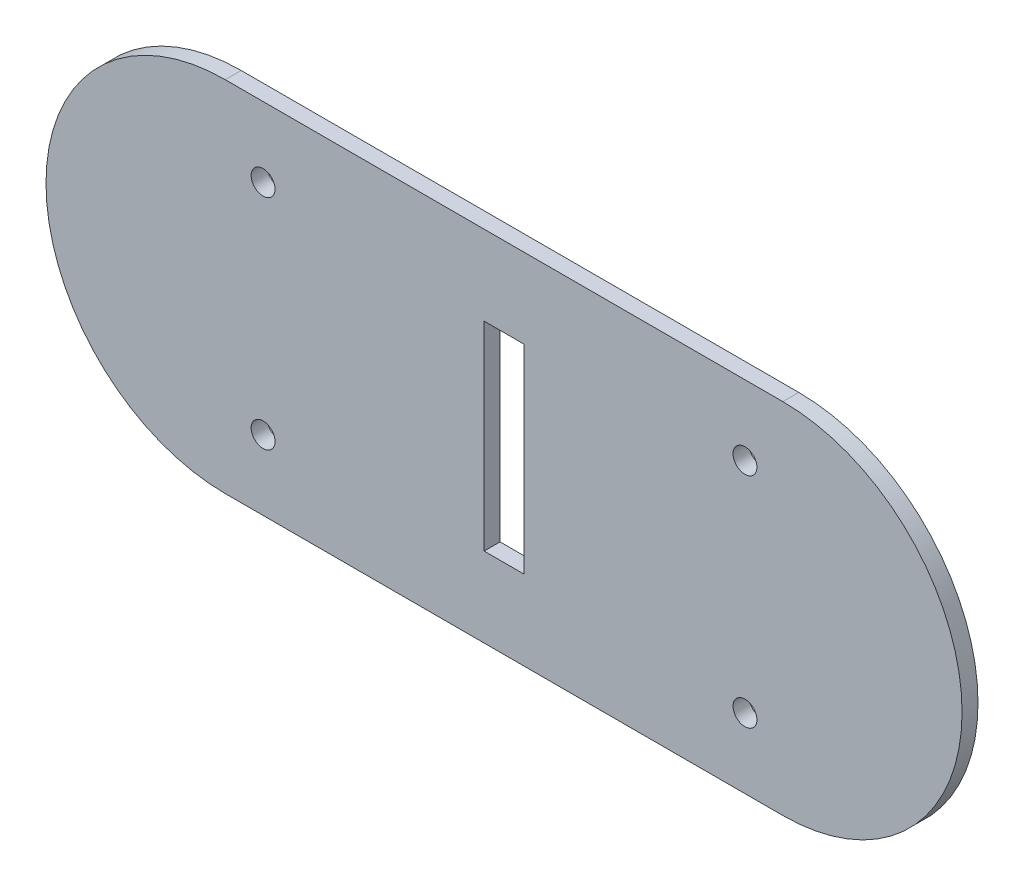
ISO-10303-21;
HEADER;
FILE_DESCRIPTION(('STEP AP214'),'2;1');
FILE_NAME('part.step','',(''),(''),'','','');
FILE_SCHEMA(('AUTOMOTIVE_DESIGN { 1 0 10303 214 1 1 1 1 }'));
ENDSEC;
DATA;
#1=APPLICATION_CONTEXT('core data for automotive mechanical design processes');
#2=APPLICATION_PROTOCOL_DEFINITION('international standard','automotive_design',2000,#1);
#3=PRODUCT_CONTEXT('',#1,'mechanical');
#4=PRODUCT('Part','Part','',(#3));
#5=PRODUCT_RELATED_PRODUCT_CATEGORY('part','',(#4));
#6=PRODUCT_DEFINITION_FORMATION('','',#4);
#7=PRODUCT_DEFINITION_CONTEXT('part definition',#1,'design');
#8=PRODUCT_DEFINITION('design','',#6,#7);
#9=PRODUCT_DEFINITION_SHAPE('','',#8);
#10=(LENGTH_UNIT() NAMED_UNIT(*) SI_UNIT(.MILLI.,.METRE.));
#11=(NAMED_UNIT(*) PLANE_ANGLE_UNIT() SI_UNIT($,.RADIAN.));
#12=(NAMED_UNIT(*) SI_UNIT($,.STERADIAN.) SOLID_ANGLE_UNIT());
#13=UNCERTAINTY_MEASURE_WITH_UNIT(LENGTH_MEASURE(1.E-05),#10,'distance_accuracy_value','');
#14=(GEOMETRIC_REPRESENTATION_CONTEXT(3) GLOBAL_UNCERTAINTY_ASSIGNED_CONTEXT((#13)) GLOBAL_UNIT_ASSIGNED_CONTEXT((#10,
#11,#12)) REPRESENTATION_CONTEXT('',''));
#15=CARTESIAN_POINT('',(0.,0.,0.));
#16=DIRECTION('',(0.,0.,1.));
#17=DIRECTION('',(1.,0.,0.));
#18=AXIS2_PLACEMENT_3D('',#15,#16,#17);
#19=CARTESIAN_POINT('',(90.1646015852963,212.057553234732,190.475370577193));
#20=DIRECTION('',(0.,0.,-1.));
#21=DIRECTION('',(-1.,0.,0.));
#22=AXIS2_PLACEMENT_3D('',#19,#20,#21);
#23=CYLINDRICAL_SURFACE('',#22,22.5);
#24=CARTESIAN_POINT('',(90.1646015852963,212.057553234732,188.475370577193));
#25=DIRECTION('',(0.,0.,1.));
#26=DIRECTION('',(1.,0.,0.));
#27=AXIS2_PLACEMENT_3D('',#24,#25,#26);
#28=CIRCLE('',#27,22.5);
#29=CARTESIAN_POINT('',(90.1646015852963,189.557553234732,188.475370577193));
#30=VERTEX_POINT('',#29);
#31=CARTESIAN_POINT('',(90.1646015852963,234.557553234732,188.475370577193));
#32=VERTEX_POINT('',#31);
#33=EDGE_CURVE('E149',#30,#32,#28,.T.);
#34=ORIENTED_EDGE('',*,*,#33,.T.);
#35=DIRECTION('',(0.,0.,-1.));
#36=VECTOR('',#35,1.);
#37=CARTESIAN_POINT('',(90.1646015852963,234.557553234732,190.475370577193));
#38=LINE('',#37,#36);
#39=CARTESIAN_POINT('',(90.1646015852963,234.557553234732,190.475370577193));
#40=VERTEX_POINT('',#39);
#41=EDGE_CURVE('E178',#40,#32,#38,.T.);
#42=ORIENTED_EDGE('',*,*,#41,.F.);
#43=CARTESIAN_POINT('',(90.1646015852963,212.057553234732,190.475370577193));
#44=DIRECTION('',(0.,0.,1.));
#45=DIRECTION('',(1.,0.,0.));
#46=AXIS2_PLACEMENT_3D('',#43,#44,#45);
#47=CIRCLE('',#46,22.5);
#48=CARTESIAN_POINT('',(90.1646015852963,189.557553234732,190.475370577193));
#49=VERTEX_POINT('',#48);
#50=EDGE_CURVE('E152',#49,#40,#47,.T.);
#51=ORIENTED_EDGE('',*,*,#50,.F.);
#52=DIRECTION('',(0.,0.,-1.));
#53=VECTOR('',#52,1.);
#54=CARTESIAN_POINT('',(90.1646015852963,189.557553234732,190.475370577193));
#55=LINE('',#54,#53);
#56=EDGE_CURVE('E162',#49,#30,#55,.T.);
#57=ORIENTED_EDGE('',*,*,#56,.T.);
#58=EDGE_LOOP('',(#34,#42,#51,#57));
#59=FACE_BOUND('',#58,.T.);
#60=ADVANCED_FACE('F35',(#59),#23,.T.);
#61=CARTESIAN_POINT('',(90.1646015852963,234.557553234732,190.475370577193));
#62=DIRECTION('',(0.,-1.,0.));
#63=DIRECTION('',(0.,0.,-1.));
#64=AXIS2_PLACEMENT_3D('',#61,#62,#63);
#65=PLANE('',#64);
#66=DIRECTION('',(-1.,0.,0.));
#67=VECTOR('',#66,1.);
#68=CARTESIAN_POINT('',(90.1646015852963,234.557553234732,188.475370577193));
#69=LINE('',#68,#67);
#70=CARTESIAN_POINT('',(20.1646015852963,234.557553234732,188.475370577193));
#71=VERTEX_POINT('',#70);
#72=EDGE_CURVE('E165',#32,#71,#69,.T.);
#73=ORIENTED_EDGE('',*,*,#72,.T.);
#74=DIRECTION('',(0.,0.,-1.));
#75=VECTOR('',#74,1.);
#76=CARTESIAN_POINT('',(20.1646015852963,234.557553234732,190.475370577193));
#77=LINE('',#76,#75);
#78=CARTESIAN_POINT('',(20.1646015852963,234.557553234732,190.475370577193));
#79=VERTEX_POINT('',#78);
#80=EDGE_CURVE('E175',#79,#71,#77,.T.);
#81=ORIENTED_EDGE('',*,*,#80,.F.);
#82=DIRECTION('',(-1.,0.,0.));
#83=VECTOR('',#82,1.);
#84=CARTESIAN_POINT('',(90.1646015852963,234.557553234732,190.475370577193));
#85=LINE('',#84,#83);
#86=EDGE_CURVE('E155',#40,#79,#85,.T.);
#87=ORIENTED_EDGE('',*,*,#86,.F.);
#88=ORIENTED_EDGE('',*,*,#41,.T.);
#89=EDGE_LOOP('',(#73,#81,#87,#88));
#90=FACE_BOUND('',#89,.T.);
#91=ADVANCED_FACE('F205',(#90),#65,.F.);
#92=CARTESIAN_POINT('',(20.1646015852963,212.057553234732,190.475370577193));
#93=DIRECTION('',(0.,0.,-1.));
#94=DIRECTION('',(-1.,0.,0.));
#95=AXIS2_PLACEMENT_3D('',#92,#93,#94);
#96=CYLINDRICAL_SURFACE('',#95,22.5);
#97=CARTESIAN_POINT('',(20.1646015852963,212.057553234732,188.475370577193));
#98=DIRECTION('',(0.,0.,1.));
#99=DIRECTION('',(1.,0.,0.));
#100=AXIS2_PLACEMENT_3D('',#97,#98,#99);
#101=CIRCLE('',#100,22.5);
#102=CARTESIAN_POINT('',(20.1646015852963,189.557553234732,188.475370577193));
#103=VERTEX_POINT('',#102);
#104=EDGE_CURVE('E167',#71,#103,#101,.T.);
#105=ORIENTED_EDGE('',*,*,#104,.T.);
#106=DIRECTION('',(0.,0.,-1.));
#107=VECTOR('',#106,1.);
#108=CARTESIAN_POINT('',(20.1646015852963,189.557553234732,190.475370577193));
#109=LINE('',#108,#107);
#110=CARTESIAN_POINT('',(20.1646015852963,189.557553234732,190.475370577193));
#111=VERTEX_POINT('',#110);
#112=EDGE_CURVE('E172',#111,#103,#109,.T.);
#113=ORIENTED_EDGE('',*,*,#112,.F.);
#114=CARTESIAN_POINT('',(20.1646015852963,212.057553234732,190.475370577193));
#115=DIRECTION('',(0.,0.,1.));
#116=DIRECTION('',(1.,0.,0.));
#117=AXIS2_PLACEMENT_3D('',#114,#115,#116);
#118=CIRCLE('',#117,22.5);
#119=EDGE_CURVE('E158',#79,#111,#118,.T.);
#120=ORIENTED_EDGE('',*,*,#119,.F.);
#121=ORIENTED_EDGE('',*,*,#80,.T.);
#122=EDGE_LOOP('',(#105,#113,#120,#121));
#123=FACE_BOUND('',#122,.T.);
#124=ADVANCED_FACE('F210',(#123),#96,.T.);
#125=CARTESIAN_POINT('',(90.1646015852963,189.557553234732,190.475370577193));
#126=DIRECTION('',(0.,1.,0.));
#127=DIRECTION('',(0.,0.,1.));
#128=AXIS2_PLACEMENT_3D('',#125,#126,#127);
#129=PLANE('',#128);
#130=DIRECTION('',(1.,0.,0.));
#131=VECTOR('',#130,1.);
#132=CARTESIAN_POINT('',(90.1646015852963,189.557553234732,188.475370577193));
#133=LINE('',#132,#131);
#134=EDGE_CURVE('E156',#103,#30,#133,.T.);
#135=ORIENTED_EDGE('',*,*,#134,.T.);
#136=ORIENTED_EDGE('',*,*,#56,.F.);
#137=DIRECTION('',(1.,0.,0.));
#138=VECTOR('',#137,1.);
#139=CARTESIAN_POINT('',(90.1646015852963,189.557553234732,190.475370577193));
#140=LINE('',#139,#138);
#141=EDGE_CURVE('E160',#111,#49,#140,.T.);
#142=ORIENTED_EDGE('',*,*,#141,.F.);
#143=ORIENTED_EDGE('',*,*,#112,.T.);
#144=EDGE_LOOP('',(#135,#136,#142,#143));
#145=FACE_BOUND('',#144,.T.);
#146=ADVANCED_FACE('F225',(#145),#129,.F.);
#147=CARTESIAN_POINT('',(90.1646015852963,212.057553234732,190.475370577193));
#148=DIRECTION('',(0.,0.,1.));
#149=DIRECTION('',(1.,0.,0.));
#150=AXIS2_PLACEMENT_3D('',#147,#148,#149);
#151=PLANE('',#150);
#152=DIRECTION('',(0.,-1.,0.));
#153=VECTOR('',#152,1.);
#154=CARTESIAN_POINT('',(52.6646015852963,224.557553234732,190.475370577193));
#155=LINE('',#154,#153);
#156=CARTESIAN_POINT('',(52.6646015852963,224.557553234732,190.475370577193));
#157=VERTEX_POINT('',#156);
#158=CARTESIAN_POINT('',(52.6646015852963,199.557553234732,190.475370577193));
#159=VERTEX_POINT('',#158);
#160=EDGE_CURVE('E49',#157,#159,#155,.T.);
#161=ORIENTED_EDGE('',*,*,#160,.F.);
#162=DIRECTION('',(-1.,0.,0.));
#163=VECTOR('',#162,1.);
#164=CARTESIAN_POINT('',(52.6646015852963,224.557553234732,190.475370577193));
#165=LINE('',#164,#163);
#166=CARTESIAN_POINT('',(57.6646015852963,224.557553234732,190.475370577193));
#167=VERTEX_POINT('',#166);
#168=EDGE_CURVE('E118',#167,#157,#165,.T.);
#169=ORIENTED_EDGE('',*,*,#168,.F.);
#170=DIRECTION('',(0.,1.,0.));
#171=VECTOR('',#170,1.);
#172=CARTESIAN_POINT('',(57.6646015852963,224.557553234732,190.475370577193));
#173=LINE('',#172,#171);
#174=CARTESIAN_POINT('',(57.6646015852963,199.557553234732,190.475370577193));
#175=VERTEX_POINT('',#174);
#176=EDGE_CURVE('E102',#175,#167,#173,.T.);
#177=ORIENTED_EDGE('',*,*,#176,.F.);
#178=DIRECTION('',(1.,0.,0.));
#179=VECTOR('',#178,1.);
#180=CARTESIAN_POINT('',(52.6646015852963,199.557553234732,190.475370577193));
#181=LINE('',#180,#179);
#182=EDGE_CURVE('E111',#159,#175,#181,.T.);
#183=ORIENTED_EDGE('',*,*,#182,.F.);
#184=EDGE_LOOP('',(#161,#169,#177,#183));
#185=FACE_BOUND('',#184,.T.);
#186=CARTESIAN_POINT('',(85.4115481479809,198.337800112773,190.475370577193));
#187=DIRECTION('',(0.,0.,1.));
#188=DIRECTION('',(-1.,0.,0.));
#189=AXIS2_PLACEMENT_3D('',#186,#187,#188);
#190=CIRCLE('',#189,1.5);
#191=CARTESIAN_POINT('',(83.9115481479809,198.337800112773,190.475370577193));
#192=VERTEX_POINT('',#191);
#193=EDGE_CURVE('E125',#192,#192,#190,.T.);
#194=ORIENTED_EDGE('',*,*,#193,.F.);
#195=EDGE_LOOP('',(#194));
#196=FACE_BOUND('',#195,.T.);
#197=CARTESIAN_POINT('',(24.9176550226118,198.337800112773,190.475370577193));
#198=DIRECTION('',(0.,0.,1.));
#199=DIRECTION('',(1.,0.,0.));
#200=AXIS2_PLACEMENT_3D('',#197,#198,#199);
#201=CIRCLE('',#200,1.5);
#202=CARTESIAN_POINT('',(26.4176550226118,198.337800112773,190.475370577193));
#203=VERTEX_POINT('',#202);
#204=EDGE_CURVE('E138',#203,#203,#201,.T.);
#205=ORIENTED_EDGE('',*,*,#204,.F.);
#206=EDGE_LOOP('',(#205));
#207=FACE_BOUND('',#206,.T.);
#208=CARTESIAN_POINT('',(24.9176550226117,225.77730635669,190.475370577193));
#209=DIRECTION('',(0.,0.,1.));
#210=DIRECTION('',(-1.,0.,0.));
#211=AXIS2_PLACEMENT_3D('',#208,#209,#210);
#212=CIRCLE('',#211,1.5);
#213=CARTESIAN_POINT('',(23.4176550226117,225.77730635669,190.475370577193));
#214=VERTEX_POINT('',#213);
#215=EDGE_CURVE('E132',#214,#214,#212,.T.);
#216=ORIENTED_EDGE('',*,*,#215,.F.);
#217=EDGE_LOOP('',(#216));
#218=FACE_BOUND('',#217,.T.);
#219=CARTESIAN_POINT('',(85.4115481479809,225.77730635669,190.475370577193));
#220=DIRECTION('',(0.,0.,1.));
#221=DIRECTION('',(1.,0.,0.));
#222=AXIS2_PLACEMENT_3D('',#219,#220,#221);
#223=CIRCLE('',#222,1.5);
#224=CARTESIAN_POINT('',(86.9115481479809,225.77730635669,190.475370577193));
#225=VERTEX_POINT('',#224);
#226=EDGE_CURVE('E131',#225,#225,#223,.T.);
#227=ORIENTED_EDGE('',*,*,#226,.F.);
#228=EDGE_LOOP('',(#227));
#229=FACE_BOUND('',#228,.T.);
#230=ORIENTED_EDGE('',*,*,#50,.T.);
#231=ORIENTED_EDGE('',*,*,#86,.T.);
#232=ORIENTED_EDGE('',*,*,#119,.T.);
#233=ORIENTED_EDGE('',*,*,#141,.T.);
#234=EDGE_LOOP('',(#230,#231,#232,#233));
#235=FACE_BOUND('',#234,.T.);
#236=ADVANCED_FACE('F115',(#185,#196,#207,#218,#229,#235),#151,.T.);
#237=CARTESIAN_POINT('',(90.1646015852963,212.057553234732,188.475370577193));
#238=DIRECTION('',(0.,0.,1.));
#239=DIRECTION('',(1.,0.,0.));
#240=AXIS2_PLACEMENT_3D('',#237,#238,#239);
#241=PLANE('',#240);
#242=DIRECTION('',(-1.,0.,0.));
#243=VECTOR('',#242,1.);
#244=CARTESIAN_POINT('',(90.1646015852963,224.557553234732,188.475370577193));
#245=LINE('',#244,#243);
#246=CARTESIAN_POINT('',(57.6646015852963,224.557553234732,188.475370577193));
#247=VERTEX_POINT('',#246);
#248=CARTESIAN_POINT('',(52.6646015852963,224.557553234732,188.475370577193));
#249=VERTEX_POINT('',#248);
#250=EDGE_CURVE('E42',#247,#249,#245,.T.);
#251=ORIENTED_EDGE('',*,*,#250,.T.);
#252=DIRECTION('',(0.,-1.,0.));
#253=VECTOR('',#252,1.);
#254=CARTESIAN_POINT('',(52.6646015852963,212.057553234732,188.475370577193));
#255=LINE('',#254,#253);
#256=CARTESIAN_POINT('',(52.6646015852963,199.557553234732,188.475370577193));
#257=VERTEX_POINT('',#256);
#258=EDGE_CURVE('E11',#249,#257,#255,.T.);
#259=ORIENTED_EDGE('',*,*,#258,.T.);
#260=DIRECTION('',(1.,0.,0.));
#261=VECTOR('',#260,1.);
#262=CARTESIAN_POINT('',(90.1646015852963,199.557553234732,188.475370577193));
#263=LINE('',#262,#261);
#264=CARTESIAN_POINT('',(57.6646015852963,199.557553234732,188.475370577193));
#265=VERTEX_POINT('',#264);
#266=EDGE_CURVE('E181',#257,#265,#263,.T.);
#267=ORIENTED_EDGE('',*,*,#266,.T.);
#268=DIRECTION('',(0.,1.,0.));
#269=VECTOR('',#268,1.);
#270=CARTESIAN_POINT('',(57.6646015852963,212.057553234732,188.475370577193));
#271=LINE('',#270,#269);
#272=EDGE_CURVE('E105',#265,#247,#271,.T.);
#273=ORIENTED_EDGE('',*,*,#272,.T.);
#274=EDGE_LOOP('',(#251,#259,#267,#273));
#275=FACE_BOUND('',#274,.T.);
#276=CARTESIAN_POINT('',(85.4115481479809,198.337800112773,188.475370577193));
#277=DIRECTION('',(0.,0.,1.));
#278=DIRECTION('',(-1.,0.,0.));
#279=AXIS2_PLACEMENT_3D('',#276,#277,#278);
#280=CIRCLE('',#279,1.5);
#281=CARTESIAN_POINT('',(83.9115481479809,198.337800112773,188.475370577193));
#282=VERTEX_POINT('',#281);
#283=EDGE_CURVE('E141',#282,#282,#280,.T.);
#284=ORIENTED_EDGE('',*,*,#283,.T.);
#285=EDGE_LOOP('',(#284));
#286=FACE_BOUND('',#285,.T.);
#287=CARTESIAN_POINT('',(24.9176550226118,198.337800112773,188.475370577193));
#288=DIRECTION('',(0.,0.,1.));
#289=DIRECTION('',(1.,0.,0.));
#290=AXIS2_PLACEMENT_3D('',#287,#288,#289);
#291=CIRCLE('',#290,1.5);
#292=CARTESIAN_POINT('',(26.4176550226118,198.337800112773,188.475370577193));
#293=VERTEX_POINT('',#292);
#294=EDGE_CURVE('E135',#293,#293,#291,.T.);
#295=ORIENTED_EDGE('',*,*,#294,.T.);
#296=EDGE_LOOP('',(#295));
#297=FACE_BOUND('',#296,.T.);
#298=CARTESIAN_POINT('',(24.9176550226117,225.77730635669,188.475370577193));
#299=DIRECTION('',(0.,0.,1.));
#300=DIRECTION('',(-1.,0.,0.));
#301=AXIS2_PLACEMENT_3D('',#298,#299,#300);
#302=CIRCLE('',#301,1.5);
#303=CARTESIAN_POINT('',(23.4176550226117,225.77730635669,188.475370577193));
#304=VERTEX_POINT('',#303);
#305=EDGE_CURVE('E128',#304,#304,#302,.T.);
#306=ORIENTED_EDGE('',*,*,#305,.T.);
#307=EDGE_LOOP('',(#306));
#308=FACE_BOUND('',#307,.T.);
#309=CARTESIAN_POINT('',(85.4115481479809,225.77730635669,188.475370577193));
#310=DIRECTION('',(0.,0.,1.));
#311=DIRECTION('',(1.,0.,0.));
#312=AXIS2_PLACEMENT_3D('',#309,#310,#311);
#313=CIRCLE('',#312,1.5);
#314=CARTESIAN_POINT('',(86.9115481479809,225.77730635669,188.475370577193));
#315=VERTEX_POINT('',#314);
#316=EDGE_CURVE('E146',#315,#315,#313,.T.);
#317=ORIENTED_EDGE('',*,*,#316,.T.);
#318=EDGE_LOOP('',(#317));
#319=FACE_BOUND('',#318,.T.);
#320=ORIENTED_EDGE('',*,*,#33,.F.);
#321=ORIENTED_EDGE('',*,*,#134,.F.);
#322=ORIENTED_EDGE('',*,*,#104,.F.);
#323=ORIENTED_EDGE('',*,*,#72,.F.);
#324=EDGE_LOOP('',(#320,#321,#322,#323));
#325=FACE_BOUND('',#324,.T.);
#326=ADVANCED_FACE('F185',(#275,#286,#297,#308,#319,#325),#241,.F.);
#327=CARTESIAN_POINT('',(85.4115481479809,225.77730635669,188.475370577193));
#328=DIRECTION('',(0.,0.,1.));
#329=DIRECTION('',(1.,0.,0.));
#330=AXIS2_PLACEMENT_3D('',#327,#328,#329);
#331=CYLINDRICAL_SURFACE('',#330,1.5);
#332=ORIENTED_EDGE('',*,*,#316,.F.);
#333=EDGE_LOOP('',(#332));
#334=FACE_BOUND('',#333,.T.);
#335=ORIENTED_EDGE('',*,*,#226,.T.);
#336=EDGE_LOOP('',(#335));
#337=FACE_BOUND('',#336,.T.);
#338=ADVANCED_FACE('F236',(#334,#337),#331,.F.);
#339=CARTESIAN_POINT('',(24.9176550226117,225.77730635669,188.475370577193));
#340=DIRECTION('',(0.,0.,1.));
#341=DIRECTION('',(1.,0.,0.));
#342=AXIS2_PLACEMENT_3D('',#339,#340,#341);
#343=CYLINDRICAL_SURFACE('',#342,1.5);
#344=ORIENTED_EDGE('',*,*,#305,.F.);
#345=EDGE_LOOP('',(#344));
#346=FACE_BOUND('',#345,.T.);
#347=ORIENTED_EDGE('',*,*,#215,.T.);
#348=EDGE_LOOP('',(#347));
#349=FACE_BOUND('',#348,.T.);
#350=ADVANCED_FACE('F240',(#346,#349),#343,.F.);
#351=CARTESIAN_POINT('',(24.9176550226118,198.337800112773,188.475370577193));
#352=DIRECTION('',(0.,0.,1.));
#353=DIRECTION('',(1.,0.,0.));
#354=AXIS2_PLACEMENT_3D('',#351,#352,#353);
#355=CYLINDRICAL_SURFACE('',#354,1.5);
#356=ORIENTED_EDGE('',*,*,#294,.F.);
#357=EDGE_LOOP('',(#356));
#358=FACE_BOUND('',#357,.T.);
#359=ORIENTED_EDGE('',*,*,#204,.T.);
#360=EDGE_LOOP('',(#359));
#361=FACE_BOUND('',#360,.T.);
#362=ADVANCED_FACE('F199',(#358,#361),#355,.F.);
#363=CARTESIAN_POINT('',(85.4115481479809,198.337800112773,188.475370577193));
#364=DIRECTION('',(0.,0.,1.));
#365=DIRECTION('',(1.,0.,0.));
#366=AXIS2_PLACEMENT_3D('',#363,#364,#365);
#367=CYLINDRICAL_SURFACE('',#366,1.5);
#368=ORIENTED_EDGE('',*,*,#283,.F.);
#369=EDGE_LOOP('',(#368));
#370=FACE_BOUND('',#369,.T.);
#371=ORIENTED_EDGE('',*,*,#193,.T.);
#372=EDGE_LOOP('',(#371));
#373=FACE_BOUND('',#372,.T.);
#374=ADVANCED_FACE('F192',(#370,#373),#367,.F.);
#375=CARTESIAN_POINT('',(52.6646015852963,224.557553234732,180.475370577193));
#376=DIRECTION('',(-1.,0.,0.));
#377=DIRECTION('',(0.,0.,1.));
#378=AXIS2_PLACEMENT_3D('',#375,#376,#377);
#379=PLANE('',#378);
#380=DIRECTION('',(0.,0.,1.));
#381=VECTOR('',#380,1.);
#382=CARTESIAN_POINT('',(52.6646015852963,224.557553234732,180.475370577193));
#383=LINE('',#382,#381);
#384=EDGE_CURVE('E123',#249,#157,#383,.T.);
#385=ORIENTED_EDGE('',*,*,#384,.T.);
#386=ORIENTED_EDGE('',*,*,#160,.T.);
#387=DIRECTION('',(0.,0.,1.));
#388=VECTOR('',#387,1.);
#389=CARTESIAN_POINT('',(52.6646015852963,199.557553234732,180.475370577193));
#390=LINE('',#389,#388);
#391=EDGE_CURVE('E108',#257,#159,#390,.T.);
#392=ORIENTED_EDGE('',*,*,#391,.F.);
#393=ORIENTED_EDGE('',*,*,#258,.F.);
#394=EDGE_LOOP('',(#385,#386,#392,#393));
#395=FACE_BOUND('',#394,.T.);
#396=ADVANCED_FACE('F190',(#395),#379,.F.);
#397=CARTESIAN_POINT('',(52.6646015852963,224.557553234732,180.475370577193));
#398=DIRECTION('',(0.,1.,0.));
#399=DIRECTION('',(0.,0.,1.));
#400=AXIS2_PLACEMENT_3D('',#397,#398,#399);
#401=PLANE('',#400);
#402=DIRECTION('',(0.,0.,1.));
#403=VECTOR('',#402,1.);
#404=CARTESIAN_POINT('',(57.6646015852963,224.557553234732,180.475370577193));
#405=LINE('',#404,#403);
#406=EDGE_CURVE('E107',#247,#167,#405,.T.);
#407=ORIENTED_EDGE('',*,*,#406,.T.);
#408=ORIENTED_EDGE('',*,*,#168,.T.);
#409=ORIENTED_EDGE('',*,*,#384,.F.);
#410=ORIENTED_EDGE('',*,*,#250,.F.);
#411=EDGE_LOOP('',(#407,#408,#409,#410));
#412=FACE_BOUND('',#411,.T.);
#413=ADVANCED_FACE('F189',(#412),#401,.F.);
#414=CARTESIAN_POINT('',(57.6646015852963,224.557553234732,180.475370577193));
#415=DIRECTION('',(1.,0.,0.));
#416=DIRECTION('',(0.,1.,0.));
#417=AXIS2_PLACEMENT_3D('',#414,#415,#416);
#418=PLANE('',#417);
#419=DIRECTION('',(0.,0.,1.));
#420=VECTOR('',#419,1.);
#421=CARTESIAN_POINT('',(57.6646015852963,199.557553234732,180.475370577193));
#422=LINE('',#421,#420);
#423=EDGE_CURVE('E57',#265,#175,#422,.T.);
#424=ORIENTED_EDGE('',*,*,#423,.T.);
#425=ORIENTED_EDGE('',*,*,#176,.T.);
#426=ORIENTED_EDGE('',*,*,#406,.F.);
#427=ORIENTED_EDGE('',*,*,#272,.F.);
#428=EDGE_LOOP('',(#424,#425,#426,#427));
#429=FACE_BOUND('',#428,.T.);
#430=ADVANCED_FACE('F99',(#429),#418,.F.);
#431=CARTESIAN_POINT('',(52.6646015852963,199.557553234732,180.475370577193));
#432=DIRECTION('',(0.,-1.,0.));
#433=DIRECTION('',(0.,0.,-1.));
#434=AXIS2_PLACEMENT_3D('',#431,#432,#433);
#435=PLANE('',#434);
#436=ORIENTED_EDGE('',*,*,#391,.T.);
#437=ORIENTED_EDGE('',*,*,#182,.T.);
#438=ORIENTED_EDGE('',*,*,#423,.F.);
#439=ORIENTED_EDGE('',*,*,#266,.F.);
#440=EDGE_LOOP('',(#436,#437,#438,#439));
#441=FACE_BOUND('',#440,.T.);
#442=ADVANCED_FACE('F112',(#441),#435,.F.);
#443=CLOSED_SHELL('',(#60,#91,#124,#146,#236,#326,#338,#350,#362,#374,#396,#413,#430,#442));
#444=MANIFOLD_SOLID_BREP('B2',#443);
#445=ADVANCED_BREP_SHAPE_REPRESENTATION('',(#18,#444),#14);
#446=SHAPE_DEFINITION_REPRESENTATION(#9,#445);
ENDSEC;
END-ISO-10303-21;
